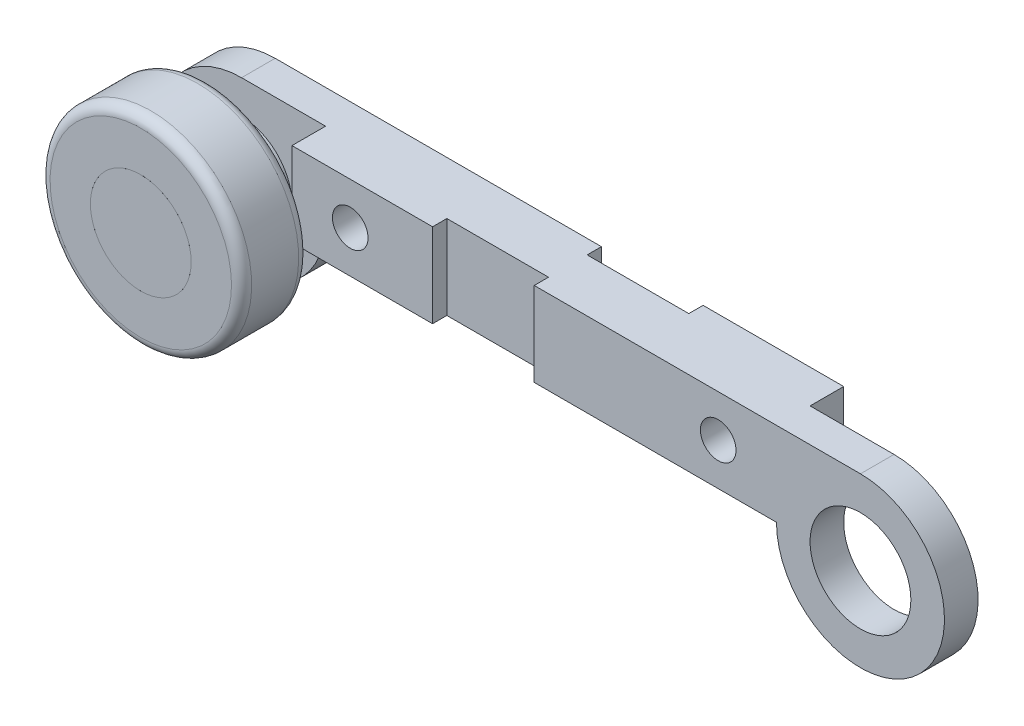
ISO-10303-21;
HEADER;
FILE_DESCRIPTION(('STEP AP214'),'2;1');
FILE_NAME('part.step','',(''),(''),'','','');
FILE_SCHEMA(('AUTOMOTIVE_DESIGN { 1 0 10303 214 1 1 1 1 }'));
ENDSEC;
DATA;
#1=APPLICATION_CONTEXT('core data for automotive mechanical design processes');
#2=APPLICATION_PROTOCOL_DEFINITION('international standard','automotive_design',2000,#1);
#3=PRODUCT_CONTEXT('',#1,'mechanical');
#4=PRODUCT('Part','Part','',(#3));
#5=PRODUCT_RELATED_PRODUCT_CATEGORY('part','',(#4));
#6=PRODUCT_DEFINITION_FORMATION('','',#4);
#7=PRODUCT_DEFINITION_CONTEXT('part definition',#1,'design');
#8=PRODUCT_DEFINITION('design','',#6,#7);
#9=PRODUCT_DEFINITION_SHAPE('','',#8);
#10=(LENGTH_UNIT() NAMED_UNIT(*) SI_UNIT(.MILLI.,.METRE.));
#11=(NAMED_UNIT(*) PLANE_ANGLE_UNIT() SI_UNIT($,.RADIAN.));
#12=(NAMED_UNIT(*) SI_UNIT($,.STERADIAN.) SOLID_ANGLE_UNIT());
#13=UNCERTAINTY_MEASURE_WITH_UNIT(LENGTH_MEASURE(1.E-05),#10,'distance_accuracy_value','');
#14=(GEOMETRIC_REPRESENTATION_CONTEXT(3) GLOBAL_UNCERTAINTY_ASSIGNED_CONTEXT((#13)) GLOBAL_UNIT_ASSIGNED_CONTEXT((#10,
#11,#12)) REPRESENTATION_CONTEXT('',''));
#15=CARTESIAN_POINT('',(0.,0.,0.));
#16=DIRECTION('',(0.,0.,1.));
#17=DIRECTION('',(1.,0.,0.));
#18=AXIS2_PLACEMENT_3D('',#15,#16,#17);
#19=CARTESIAN_POINT('',(-100.953675493499,9.51376137457757,274.2));
#20=DIRECTION('',(0.,0.,-1.));
#21=DIRECTION('',(0.812680732715364,-0.58270921279247,0.));
#22=AXIS2_PLACEMENT_3D('',#19,#20,#21);
#23=CYLINDRICAL_SURFACE('',#22,15.);
#24=CARTESIAN_POINT('',(-100.953675493499,9.51376137457757,274.2));
#25=DIRECTION('',(0.,0.,1.));
#26=DIRECTION('',(-0.812680732715364,0.58270921279247,0.));
#27=AXIS2_PLACEMENT_3D('',#24,#25,#26);
#28=CIRCLE('',#27,15.);
#29=CARTESIAN_POINT('',(-113.14388648423,18.2543995664646,274.2));
#30=VERTEX_POINT('',#29);
#31=EDGE_CURVE('P0_E10',#30,#30,#28,.T.);
#32=ORIENTED_EDGE('',*,*,#31,.F.);
#33=EDGE_LOOP('',(#32));
#34=FACE_BOUND('',#33,.T.);
#35=CARTESIAN_POINT('',(-100.953675493499,9.51376137457757,234.2));
#36=DIRECTION('',(0.,0.,-1.));
#37=DIRECTION('',(0.812680732715364,-0.58270921279247,0.));
#38=AXIS2_PLACEMENT_3D('',#35,#36,#37);
#39=CIRCLE('',#38,15.);
#40=CARTESIAN_POINT('',(-88.7634645027686,0.773123182690525,234.2));
#41=VERTEX_POINT('',#40);
#42=EDGE_CURVE('P0_E21',#41,#41,#39,.T.);
#43=ORIENTED_EDGE('',*,*,#42,.F.);
#44=EDGE_LOOP('',(#43));
#45=FACE_BOUND('',#44,.T.);
#46=ADVANCED_FACE('P0_F15',(#34,#45),#23,.T.);
#47=CARTESIAN_POINT('',(-100.953675493499,9.51376137457757,274.2));
#48=DIRECTION('',(0.,0.,1.));
#49=DIRECTION('',(-0.812680732715364,0.58270921279247,0.));
#50=AXIS2_PLACEMENT_3D('',#47,#48,#49);
#51=PLANE('',#50);
#52=ORIENTED_EDGE('',*,*,#31,.T.);
#53=EDGE_LOOP('',(#52));
#54=FACE_BOUND('',#53,.T.);
#55=ADVANCED_FACE('P0_F49',(#54),#51,.T.);
#56=CARTESIAN_POINT('',(-100.953675493499,9.51376137457757,229.2));
#57=DIRECTION('',(0.,0.,1.));
#58=DIRECTION('',(-0.812680732715364,0.58270921279247,0.));
#59=AXIS2_PLACEMENT_3D('',#56,#57,#58);
#60=CYLINDRICAL_SURFACE('',#59,20.);
#61=CARTESIAN_POINT('',(-100.953675493499,9.51376137457757,229.2));
#62=DIRECTION('',(0.,0.,-1.));
#63=DIRECTION('',(0.812680732715364,-0.58270921279247,0.));
#64=AXIS2_PLACEMENT_3D('',#61,#62,#63);
#65=CIRCLE('',#64,20.);
#66=CARTESIAN_POINT('',(-84.7000608391918,-2.14042288127182,229.2));
#67=VERTEX_POINT('',#66);
#68=EDGE_CURVE('P0_E25',#67,#67,#65,.T.);
#69=ORIENTED_EDGE('',*,*,#68,.F.);
#70=EDGE_LOOP('',(#69));
#71=FACE_BOUND('',#70,.T.);
#72=CARTESIAN_POINT('',(-100.953675493499,9.51376137457757,234.2));
#73=DIRECTION('',(0.,0.,-1.));
#74=DIRECTION('',(0.812680732715364,-0.58270921279247,0.));
#75=AXIS2_PLACEMENT_3D('',#72,#73,#74);
#76=CIRCLE('',#75,20.);
#77=CARTESIAN_POINT('',(-84.7000608391918,-2.14042288127182,234.2));
#78=VERTEX_POINT('',#77);
#79=EDGE_CURVE('P0_E29',#78,#78,#76,.T.);
#80=ORIENTED_EDGE('',*,*,#79,.T.);
#81=EDGE_LOOP('',(#80));
#82=FACE_BOUND('',#81,.T.);
#83=ADVANCED_FACE('P0_F35',(#71,#82),#60,.T.);
#84=CARTESIAN_POINT('',(-100.953675493499,9.51376137457757,229.2));
#85=DIRECTION('',(0.,0.,-1.));
#86=DIRECTION('',(0.812680732715364,-0.58270921279247,0.));
#87=AXIS2_PLACEMENT_3D('',#84,#85,#86);
#88=PLANE('',#87);
#89=ORIENTED_EDGE('',*,*,#68,.T.);
#90=EDGE_LOOP('',(#89));
#91=FACE_BOUND('',#90,.T.);
#92=ADVANCED_FACE('P0_F39',(#91),#88,.T.);
#93=CARTESIAN_POINT('',(-100.953675493499,9.51376137457757,234.2));
#94=DIRECTION('',(0.,0.,-1.));
#95=DIRECTION('',(0.812680732715364,-0.58270921279247,0.));
#96=AXIS2_PLACEMENT_3D('',#93,#94,#95);
#97=PLANE('',#96);
#98=ORIENTED_EDGE('',*,*,#42,.T.);
#99=EDGE_LOOP('',(#98));
#100=FACE_BOUND('',#99,.T.);
#101=ORIENTED_EDGE('',*,*,#79,.F.);
#102=EDGE_LOOP('',(#101));
#103=FACE_BOUND('',#102,.T.);
#104=ADVANCED_FACE('P0_F37',(#100,#103),#97,.F.);
#105=CLOSED_SHELL('',(#46,#55,#83,#92,#104));
#106=MANIFOLD_SOLID_BREP('P0_B1',#105);
#107=CARTESIAN_POINT('',(-100.953675493499,9.51376137457759,274.2));
#108=DIRECTION('',(0.,0.,1.));
#109=DIRECTION('',(0.429903138719744,0.902875014228942,0.));
#110=AXIS2_PLACEMENT_3D('',#107,#108,#109);
#111=PLANE('',#110);
#112=CARTESIAN_POINT('',(-100.953675493499,9.51376137457759,274.2));
#113=DIRECTION('',(0.,0.,1.));
#114=DIRECTION('',(0.429903138719744,0.902875014228942,0.));
#115=AXIS2_PLACEMENT_3D('',#112,#113,#114);
#116=CIRCLE('',#115,27.);
#117=CARTESIAN_POINT('',(-89.346290748066,33.891386758759,274.2));
#118=VERTEX_POINT('',#117);
#119=EDGE_CURVE('P1_E10',#118,#118,#116,.T.);
#120=ORIENTED_EDGE('',*,*,#119,.T.);
#121=EDGE_LOOP('',(#120));
#122=FACE_BOUND('',#121,.T.);
#123=CARTESIAN_POINT('',(-100.953675493499,9.51376137457759,274.2));
#124=DIRECTION('',(0.,0.,1.));
#125=DIRECTION('',(0.429903138719744,0.902875014228942,0.));
#126=AXIS2_PLACEMENT_3D('',#123,#124,#125);
#127=CIRCLE('',#126,15.);
#128=CARTESIAN_POINT('',(-94.5051284127029,23.0568865880117,274.2));
#129=VERTEX_POINT('',#128);
#130=EDGE_CURVE('P1_E35',#129,#129,#127,.T.);
#131=ORIENTED_EDGE('',*,*,#130,.F.);
#132=EDGE_LOOP('',(#131));
#133=FACE_BOUND('',#132,.T.);
#134=ADVANCED_FACE('P1_F15',(#122,#133),#111,.T.);
#135=CARTESIAN_POINT('',(-100.953675493499,9.51376137457759,254.2));
#136=DIRECTION('',(0.,0.,1.));
#137=DIRECTION('',(0.429903138719744,0.902875014228942,0.));
#138=AXIS2_PLACEMENT_3D('',#135,#136,#137);
#139=PLANE('',#138);
#140=CARTESIAN_POINT('',(-100.953675493499,9.51376137457759,254.2));
#141=DIRECTION('',(0.,0.,1.));
#142=DIRECTION('',(0.429903138719744,0.902875014228942,0.));
#143=AXIS2_PLACEMENT_3D('',#140,#141,#142);
#144=CIRCLE('',#143,27.);
#145=CARTESIAN_POINT('',(-89.346290748066,33.891386758759,254.2));
#146=VERTEX_POINT('',#145);
#147=EDGE_CURVE('P1_E22',#146,#146,#144,.F.);
#148=ORIENTED_EDGE('',*,*,#147,.T.);
#149=EDGE_LOOP('',(#148));
#150=FACE_BOUND('',#149,.T.);
#151=CARTESIAN_POINT('',(-100.953675493499,9.51376137457759,254.2));
#152=DIRECTION('',(0.,0.,1.));
#153=DIRECTION('',(0.429903138719744,0.902875014228942,0.));
#154=AXIS2_PLACEMENT_3D('',#151,#152,#153);
#155=CIRCLE('',#154,15.);
#156=CARTESIAN_POINT('',(-94.5051284127029,23.0568865880117,254.2));
#157=VERTEX_POINT('',#156);
#158=EDGE_CURVE('P1_E36',#157,#157,#155,.T.);
#159=ORIENTED_EDGE('',*,*,#158,.T.);
#160=EDGE_LOOP('',(#159));
#161=FACE_BOUND('',#160,.T.);
#162=ADVANCED_FACE('P1_F46',(#150,#161),#139,.F.);
#163=CARTESIAN_POINT('',(-100.953675493499,9.51376137457759,274.2));
#164=DIRECTION('',(0.,0.,-1.));
#165=DIRECTION('',(-0.429903138719744,-0.902875014228942,0.));
#166=AXIS2_PLACEMENT_3D('',#163,#164,#165);
#167=CYLINDRICAL_SURFACE('',#166,30.);
#168=CARTESIAN_POINT('',(-100.953675493499,9.51376137457759,257.2));
#169=DIRECTION('',(0.,0.,1.));
#170=DIRECTION('',(0.429903138719744,0.902875014228942,0.));
#171=AXIS2_PLACEMENT_3D('',#168,#169,#170);
#172=CIRCLE('',#171,30.);
#173=CARTESIAN_POINT('',(-88.0565813319068,36.6000118014459,257.2));
#174=VERTEX_POINT('',#173);
#175=EDGE_CURVE('P1_E26',#174,#174,#172,.T.);
#176=ORIENTED_EDGE('',*,*,#175,.T.);
#177=EDGE_LOOP('',(#176));
#178=FACE_BOUND('',#177,.T.);
#179=CARTESIAN_POINT('',(-100.953675493499,9.51376137457759,271.2));
#180=DIRECTION('',(0.,0.,1.));
#181=DIRECTION('',(0.429903138719744,0.902875014228942,0.));
#182=AXIS2_PLACEMENT_3D('',#179,#180,#181);
#183=CIRCLE('',#182,30.);
#184=CARTESIAN_POINT('',(-88.0565813319068,36.6000118014459,271.2));
#185=VERTEX_POINT('',#184);
#186=EDGE_CURVE('P1_E30',#185,#185,#183,.F.);
#187=ORIENTED_EDGE('',*,*,#186,.T.);
#188=EDGE_LOOP('',(#187));
#189=FACE_BOUND('',#188,.T.);
#190=ADVANCED_FACE('P1_F52',(#178,#189),#167,.T.);
#191=CARTESIAN_POINT('',(-100.953675493499,9.51376137457759,274.2));
#192=DIRECTION('',(0.,0.,-1.));
#193=DIRECTION('',(-0.429903138719744,-0.902875014228942,0.));
#194=AXIS2_PLACEMENT_3D('',#191,#192,#193);
#195=CYLINDRICAL_SURFACE('',#194,15.);
#196=ORIENTED_EDGE('',*,*,#130,.T.);
#197=EDGE_LOOP('',(#196));
#198=FACE_BOUND('',#197,.T.);
#199=ORIENTED_EDGE('',*,*,#158,.F.);
#200=EDGE_LOOP('',(#199));
#201=FACE_BOUND('',#200,.T.);
#202=ADVANCED_FACE('P1_F42',(#198,#201),#195,.F.);
#203=CARTESIAN_POINT('',(-100.953675493499,9.51376137457759,257.2));
#204=DIRECTION('',(0.,0.,1.));
#205=DIRECTION('',(0.429903138719744,0.902875014228942,0.));
#206=AXIS2_PLACEMENT_3D('',#203,#204,#205);
#207=TOROIDAL_SURFACE('',#206,27.,3.);
#208=ORIENTED_EDGE('',*,*,#147,.F.);
#209=EDGE_LOOP('',(#208));
#210=FACE_BOUND('',#209,.T.);
#211=ORIENTED_EDGE('',*,*,#175,.F.);
#212=EDGE_LOOP('',(#211));
#213=FACE_BOUND('',#212,.T.);
#214=ADVANCED_FACE('P1_F58',(#210,#213),#207,.T.);
#215=CARTESIAN_POINT('',(-100.953675493499,9.51376137457759,271.2));
#216=DIRECTION('',(0.,0.,1.));
#217=DIRECTION('',(0.429903138719744,0.902875014228942,0.));
#218=AXIS2_PLACEMENT_3D('',#215,#216,#217);
#219=TOROIDAL_SURFACE('',#218,27.,3.);
#220=ORIENTED_EDGE('',*,*,#186,.F.);
#221=EDGE_LOOP('',(#220));
#222=FACE_BOUND('',#221,.T.);
#223=ORIENTED_EDGE('',*,*,#119,.F.);
#224=EDGE_LOOP('',(#223));
#225=FACE_BOUND('',#224,.T.);
#226=ADVANCED_FACE('P1_F17',(#222,#225),#219,.T.);
#227=CLOSED_SHELL('',(#134,#162,#190,#202,#214,#226));
#228=MANIFOLD_SOLID_BREP('P1_B1',#227);
#229=CARTESIAN_POINT('',(-100.953675493499,9.51376137457759,234.2));
#230=DIRECTION('',(0.,0.,1.));
#231=DIRECTION('',(1.,0.,0.));
#232=AXIS2_PLACEMENT_3D('',#229,#230,#231);
#233=PLANE('',#232);
#234=CARTESIAN_POINT('',(-100.953675493499,9.51376137457759,234.2));
#235=DIRECTION('',(0.,0.,1.));
#236=DIRECTION('',(1.,0.,0.));
#237=AXIS2_PLACEMENT_3D('',#234,#235,#236);
#238=CIRCLE('',#237,15.);
#239=CARTESIAN_POINT('',(-85.9536754934991,9.51376137457759,234.2));
#240=VERTEX_POINT('',#239);
#241=EDGE_CURVE('P2_E231',#240,#240,#238,.T.);
#242=ORIENTED_EDGE('',*,*,#241,.T.);
#243=EDGE_LOOP('',(#242));
#244=FACE_BOUND('',#243,.T.);
#245=CARTESIAN_POINT('',(-58.6086401104718,22.0137613745776,234.2));
#246=DIRECTION('',(0.,0.,1.));
#247=DIRECTION('',(1.,0.,0.));
#248=AXIS2_PLACEMENT_3D('',#245,#246,#247);
#249=CIRCLE('',#248,5.29788538285587);
#250=CARTESIAN_POINT('',(-53.3107547276159,22.0137613745776,234.2));
#251=VERTEX_POINT('',#250);
#252=EDGE_CURVE('P2_E196',#251,#251,#249,.F.);
#253=ORIENTED_EDGE('',*,*,#252,.F.);
#254=EDGE_LOOP('',(#253));
#255=FACE_BOUND('',#254,.T.);
#256=DIRECTION('',(-1.,0.,0.));
#257=VECTOR('',#256,1.);
#258=CARTESIAN_POINT('',(-100.953675493499,34.5137613745776,234.2));
#259=LINE('',#258,#257);
#260=CARTESIAN_POINT('',(-3.85367549349908,34.5137613745776,234.2));
#261=VERTEX_POINT('',#260);
#262=CARTESIAN_POINT('',(-100.953675493499,34.5137613745776,234.2));
#263=VERTEX_POINT('',#262);
#264=EDGE_CURVE('P2_E252',#261,#263,#259,.T.);
#265=ORIENTED_EDGE('',*,*,#264,.F.);
#266=DIRECTION('',(0.,1.,0.));
#267=VECTOR('',#266,1.);
#268=CARTESIAN_POINT('',(-3.85367549349908,3.51376137457758,234.2));
#269=LINE('',#268,#267);
#270=CARTESIAN_POINT('',(-3.85367549349908,9.51376137457759,234.2));
#271=VERTEX_POINT('',#270);
#272=EDGE_CURVE('P2_E154',#271,#261,#269,.T.);
#273=ORIENTED_EDGE('',*,*,#272,.F.);
#274=DIRECTION('',(1.,0.,0.));
#275=VECTOR('',#274,1.);
#276=CARTESIAN_POINT('',(-75.9536754934991,9.51376137457759,234.2));
#277=LINE('',#276,#275);
#278=CARTESIAN_POINT('',(-75.9536754934991,9.51376137457759,234.2));
#279=VERTEX_POINT('',#278);
#280=EDGE_CURVE('P2_E249',#279,#271,#277,.T.);
#281=ORIENTED_EDGE('',*,*,#280,.F.);
#282=CARTESIAN_POINT('',(-100.953675493499,9.51376137457759,234.2));
#283=DIRECTION('',(0.,0.,1.));
#284=DIRECTION('',(1.,0.,0.));
#285=AXIS2_PLACEMENT_3D('',#282,#283,#284);
#286=CIRCLE('',#285,25.);
#287=EDGE_CURVE('P2_E234',#263,#279,#286,.T.);
#288=ORIENTED_EDGE('',*,*,#287,.F.);
#289=EDGE_LOOP('',(#265,#273,#281,#288));
#290=FACE_BOUND('',#289,.T.);
#291=ADVANCED_FACE('P2_F17',(#244,#255,#290),#233,.F.);
#292=CARTESIAN_POINT('',(-100.953675493499,9.51376137457759,254.2));
#293=DIRECTION('',(0.,0.,1.));
#294=DIRECTION('',(1.,0.,0.));
#295=AXIS2_PLACEMENT_3D('',#292,#293,#294);
#296=PLANE('',#295);
#297=DIRECTION('',(0.,1.,0.));
#298=VECTOR('',#297,1.);
#299=CARTESIAN_POINT('',(-34.1064185010502,3.51376137457758,254.2));
#300=LINE('',#299,#298);
#301=CARTESIAN_POINT('',(-34.1064185010502,9.51376137457759,254.2));
#302=VERTEX_POINT('',#301);
#303=CARTESIAN_POINT('',(-34.1064185010502,34.5137613745776,254.2));
#304=VERTEX_POINT('',#303);
#305=EDGE_CURVE('P2_E170',#302,#304,#300,.T.);
#306=ORIENTED_EDGE('',*,*,#305,.T.);
#307=DIRECTION('',(-1.,0.,0.));
#308=VECTOR('',#307,1.);
#309=CARTESIAN_POINT('',(-100.953675493499,34.5137613745776,254.2));
#310=LINE('',#309,#308);
#311=CARTESIAN_POINT('',(-75.9536754934991,34.5137613745776,254.2));
#312=VERTEX_POINT('',#311);
#313=EDGE_CURVE('P2_E241',#304,#312,#310,.T.);
#314=ORIENTED_EDGE('',*,*,#313,.T.);
#315=DIRECTION('',(0.,1.,0.));
#316=VECTOR('',#315,1.);
#317=CARTESIAN_POINT('',(-75.9536754934991,-49.4862386254224,254.2));
#318=LINE('',#317,#316);
#319=CARTESIAN_POINT('',(-75.9536754934991,9.51376137457759,254.2));
#320=VERTEX_POINT('',#319);
#321=EDGE_CURVE('P2_E220',#320,#312,#318,.T.);
#322=ORIENTED_EDGE('',*,*,#321,.F.);
#323=DIRECTION('',(1.,0.,0.));
#324=VECTOR('',#323,1.);
#325=CARTESIAN_POINT('',(-75.9536754934991,9.51376137457759,254.2));
#326=LINE('',#325,#324);
#327=EDGE_CURVE('P2_E235',#320,#302,#326,.T.);
#328=ORIENTED_EDGE('',*,*,#327,.T.);
#329=EDGE_LOOP('',(#306,#314,#322,#328));
#330=FACE_BOUND('',#329,.T.);
#331=CARTESIAN_POINT('',(-58.6086401104718,22.0137613745776,254.2));
#332=DIRECTION('',(0.,0.,1.));
#333=DIRECTION('',(1.,0.,0.));
#334=AXIS2_PLACEMENT_3D('',#331,#332,#333);
#335=CIRCLE('',#334,5.29788538285587);
#336=CARTESIAN_POINT('',(-53.3107547276159,22.0137613745776,254.2));
#337=VERTEX_POINT('',#336);
#338=EDGE_CURVE('P2_E193',#337,#337,#335,.T.);
#339=ORIENTED_EDGE('',*,*,#338,.F.);
#340=EDGE_LOOP('',(#339));
#341=FACE_BOUND('',#340,.T.);
#342=ADVANCED_FACE('P2_F276',(#330,#341),#296,.T.);
#343=DIRECTION('',(0.,1.,0.));
#344=VECTOR('',#343,1.);
#345=CARTESIAN_POINT('',(-3.85367549349908,3.51376137457758,254.2));
#346=LINE('',#345,#344);
#347=CARTESIAN_POINT('',(-3.85367549349908,9.51376137457759,254.2));
#348=VERTEX_POINT('',#347);
#349=CARTESIAN_POINT('',(-3.85367549349908,34.5137613745776,254.2));
#350=VERTEX_POINT('',#349);
#351=EDGE_CURVE('P2_E42',#348,#350,#346,.T.);
#352=ORIENTED_EDGE('',*,*,#351,.F.);
#353=CARTESIAN_POINT('',(68.2463245065009,9.51376137457759,254.2));
#354=VERTEX_POINT('',#353);
#355=EDGE_CURVE('P2_E239',#348,#354,#326,.T.);
#356=ORIENTED_EDGE('',*,*,#355,.T.);
#357=CARTESIAN_POINT('',(93.2463245065009,9.51376137457759,254.2));
#358=DIRECTION('',(0.,0.,1.));
#359=DIRECTION('',(1.,0.,0.));
#360=AXIS2_PLACEMENT_3D('',#357,#358,#359);
#361=CIRCLE('',#360,25.);
#362=CARTESIAN_POINT('',(93.2463245065009,34.5137613745776,254.2));
#363=VERTEX_POINT('',#362);
#364=EDGE_CURVE('P2_E238',#354,#363,#361,.T.);
#365=ORIENTED_EDGE('',*,*,#364,.T.);
#366=EDGE_CURVE('P2_E242',#363,#350,#310,.T.);
#367=ORIENTED_EDGE('',*,*,#366,.T.);
#368=EDGE_LOOP('',(#352,#356,#365,#367));
#369=FACE_BOUND('',#368,.T.);
#370=CARTESIAN_POINT('',(50.9012891234736,22.0137613745776,254.2));
#371=DIRECTION('',(0.,0.,1.));
#372=DIRECTION('',(-1.,0.,0.));
#373=AXIS2_PLACEMENT_3D('',#370,#371,#372);
#374=CIRCLE('',#373,5.29788538285587);
#375=CARTESIAN_POINT('',(45.6034037406178,22.0137613745776,254.2));
#376=VERTEX_POINT('',#375);
#377=EDGE_CURVE('P2_E187',#376,#376,#374,.T.);
#378=ORIENTED_EDGE('',*,*,#377,.F.);
#379=EDGE_LOOP('',(#378));
#380=FACE_BOUND('',#379,.T.);
#381=CARTESIAN_POINT('',(93.2463245065009,9.51376137457759,254.2));
#382=DIRECTION('',(0.,0.,1.));
#383=DIRECTION('',(1.,0.,0.));
#384=AXIS2_PLACEMENT_3D('',#381,#382,#383);
#385=CIRCLE('',#384,15.);
#386=CARTESIAN_POINT('',(108.246324506501,9.51376137457759,254.2));
#387=VERTEX_POINT('',#386);
#388=EDGE_CURVE('P2_E228',#387,#387,#385,.T.);
#389=ORIENTED_EDGE('',*,*,#388,.F.);
#390=EDGE_LOOP('',(#389));
#391=FACE_BOUND('',#390,.T.);
#392=ADVANCED_FACE('P2_F310',(#369,#380,#391),#296,.T.);
#393=CARTESIAN_POINT('',(50.9012891234736,22.0137613745776,234.2));
#394=DIRECTION('',(0.,0.,1.));
#395=DIRECTION('',(1.,0.,0.));
#396=AXIS2_PLACEMENT_3D('',#393,#394,#395);
#397=CIRCLE('',#396,5.29788538285587);
#398=CARTESIAN_POINT('',(56.1991745063295,22.0137613745776,234.2));
#399=VERTEX_POINT('',#398);
#400=EDGE_CURVE('P2_E190',#399,#399,#397,.F.);
#401=ORIENTED_EDGE('',*,*,#400,.F.);
#402=EDGE_LOOP('',(#401));
#403=FACE_BOUND('',#402,.T.);
#404=CARTESIAN_POINT('',(26.399067514052,9.51376137457759,234.2));
#405=VERTEX_POINT('',#404);
#406=CARTESIAN_POINT('',(68.2463245065009,9.51376137457759,234.2));
#407=VERTEX_POINT('',#406);
#408=EDGE_CURVE('P2_E248',#405,#407,#277,.T.);
#409=ORIENTED_EDGE('',*,*,#408,.F.);
#410=DIRECTION('',(0.,1.,0.));
#411=VECTOR('',#410,1.);
#412=CARTESIAN_POINT('',(26.399067514052,3.51376137457758,234.2));
#413=LINE('',#412,#411);
#414=CARTESIAN_POINT('',(26.399067514052,34.5137613745776,234.2));
#415=VERTEX_POINT('',#414);
#416=EDGE_CURVE('P2_E137',#405,#415,#413,.T.);
#417=ORIENTED_EDGE('',*,*,#416,.T.);
#418=CARTESIAN_POINT('',(68.2463245065009,34.5137613745776,234.2));
#419=VERTEX_POINT('',#418);
#420=EDGE_CURVE('P2_E149',#419,#415,#259,.T.);
#421=ORIENTED_EDGE('',*,*,#420,.F.);
#422=DIRECTION('',(0.,1.,0.));
#423=VECTOR('',#422,1.);
#424=CARTESIAN_POINT('',(68.2463245065009,-49.4862386254224,234.2));
#425=LINE('',#424,#423);
#426=EDGE_CURVE('P2_E205',#407,#419,#425,.T.);
#427=ORIENTED_EDGE('',*,*,#426,.F.);
#428=EDGE_LOOP('',(#409,#417,#421,#427));
#429=FACE_BOUND('',#428,.T.);
#430=ADVANCED_FACE('P2_F278',(#403,#429),#233,.F.);
#431=CARTESIAN_POINT('',(-100.953675493499,9.51376137457759,254.2));
#432=DIRECTION('',(0.,0.,-1.));
#433=DIRECTION('',(-1.,0.,0.));
#434=AXIS2_PLACEMENT_3D('',#431,#432,#433);
#435=CYLINDRICAL_SURFACE('',#434,25.);
#436=CARTESIAN_POINT('',(-100.953675493499,9.51376137457759,244.2));
#437=DIRECTION('',(0.,0.,-1.));
#438=DIRECTION('',(-1.,0.,0.));
#439=AXIS2_PLACEMENT_3D('',#436,#437,#438);
#440=CIRCLE('',#439,25.);
#441=CARTESIAN_POINT('',(-75.9536754934991,9.51376137457759,244.2));
#442=VERTEX_POINT('',#441);
#443=CARTESIAN_POINT('',(-100.953675493499,34.5137613745776,244.2));
#444=VERTEX_POINT('',#443);
#445=EDGE_CURVE('P2_E226',#442,#444,#440,.T.);
#446=ORIENTED_EDGE('',*,*,#445,.T.);
#447=DIRECTION('',(0.,0.,-1.));
#448=VECTOR('',#447,1.);
#449=CARTESIAN_POINT('',(-100.953675493499,34.5137613745776,254.2));
#450=LINE('',#449,#448);
#451=EDGE_CURVE('P2_E245',#444,#263,#450,.T.);
#452=ORIENTED_EDGE('',*,*,#451,.T.);
#453=ORIENTED_EDGE('',*,*,#287,.T.);
#454=DIRECTION('',(0.,0.,-1.));
#455=VECTOR('',#454,1.);
#456=CARTESIAN_POINT('',(-75.9536754934991,9.51376137457759,254.2));
#457=LINE('',#456,#455);
#458=EDGE_CURVE('P2_E26',#442,#279,#457,.T.);
#459=ORIENTED_EDGE('',*,*,#458,.F.);
#460=EDGE_LOOP('',(#446,#452,#453,#459));
#461=FACE_BOUND('',#460,.T.);
#462=ADVANCED_FACE('P2_F19',(#461),#435,.T.);
#463=CARTESIAN_POINT('',(-75.9536754934991,9.51376137457759,254.2));
#464=DIRECTION('',(0.,1.,0.));
#465=DIRECTION('',(0.,0.,1.));
#466=AXIS2_PLACEMENT_3D('',#463,#464,#465);
#467=PLANE('',#466);
#468=ORIENTED_EDGE('',*,*,#280,.T.);
#469=DIRECTION('',(0.,0.,1.));
#470=VECTOR('',#469,1.);
#471=CARTESIAN_POINT('',(-3.85367549349908,9.51376137457759,254.2));
#472=LINE('',#471,#470);
#473=CARTESIAN_POINT('',(-3.85367549349908,9.51376137457759,238.449478601871));
#474=VERTEX_POINT('',#473);
#475=EDGE_CURVE('P2_E160',#271,#474,#472,.T.);
#476=ORIENTED_EDGE('',*,*,#475,.T.);
#477=DIRECTION('',(1.,0.,0.));
#478=VECTOR('',#477,1.);
#479=CARTESIAN_POINT('',(-75.9536754934991,9.51376137457759,238.449478601871));
#480=LINE('',#479,#478);
#481=CARTESIAN_POINT('',(26.399067514052,9.51376137457759,238.449478601871));
#482=VERTEX_POINT('',#481);
#483=EDGE_CURVE('P2_E156',#474,#482,#480,.T.);
#484=ORIENTED_EDGE('',*,*,#483,.T.);
#485=DIRECTION('',(0.,0.,-1.));
#486=VECTOR('',#485,1.);
#487=CARTESIAN_POINT('',(26.399067514052,9.51376137457759,254.2));
#488=LINE('',#487,#486);
#489=EDGE_CURVE('P2_E134',#482,#405,#488,.T.);
#490=ORIENTED_EDGE('',*,*,#489,.T.);
#491=ORIENTED_EDGE('',*,*,#408,.T.);
#492=DIRECTION('',(0.,0.,-1.));
#493=VECTOR('',#492,1.);
#494=CARTESIAN_POINT('',(68.2463245065009,9.51376137457759,254.2));
#495=LINE('',#494,#493);
#496=CARTESIAN_POINT('',(68.2463245065009,9.51376137457759,244.2));
#497=VERTEX_POINT('',#496);
#498=EDGE_CURVE('P2_E211',#497,#407,#495,.T.);
#499=ORIENTED_EDGE('',*,*,#498,.F.);
#500=DIRECTION('',(0.,0.,-1.));
#501=VECTOR('',#500,1.);
#502=CARTESIAN_POINT('',(68.2463245065009,9.51376137457759,254.2));
#503=LINE('',#502,#501);
#504=EDGE_CURVE('P2_E259',#354,#497,#503,.T.);
#505=ORIENTED_EDGE('',*,*,#504,.F.);
#506=ORIENTED_EDGE('',*,*,#355,.F.);
#507=DIRECTION('',(0.,0.,-1.));
#508=VECTOR('',#507,1.);
#509=CARTESIAN_POINT('',(-3.85367549349908,9.51376137457759,254.2));
#510=LINE('',#509,#508);
#511=CARTESIAN_POINT('',(-3.85367549349908,9.51376137457759,249.950521398129));
#512=VERTEX_POINT('',#511);
#513=EDGE_CURVE('P2_E173',#348,#512,#510,.T.);
#514=ORIENTED_EDGE('',*,*,#513,.T.);
#515=DIRECTION('',(-1.,0.,0.));
#516=VECTOR('',#515,1.);
#517=CARTESIAN_POINT('',(-75.9536754934991,9.51376137457759,249.950521398129));
#518=LINE('',#517,#516);
#519=CARTESIAN_POINT('',(-34.1064185010502,9.51376137457759,249.950521398129));
#520=VERTEX_POINT('',#519);
#521=EDGE_CURVE('P2_E181',#512,#520,#518,.T.);
#522=ORIENTED_EDGE('',*,*,#521,.T.);
#523=DIRECTION('',(0.,0.,1.));
#524=VECTOR('',#523,1.);
#525=CARTESIAN_POINT('',(-34.1064185010502,9.51376137457759,254.2));
#526=LINE('',#525,#524);
#527=EDGE_CURVE('P2_E184',#520,#302,#526,.T.);
#528=ORIENTED_EDGE('',*,*,#527,.T.);
#529=ORIENTED_EDGE('',*,*,#327,.F.);
#530=EDGE_CURVE('P2_E11',#320,#442,#457,.T.);
#531=ORIENTED_EDGE('',*,*,#530,.T.);
#532=ORIENTED_EDGE('',*,*,#458,.T.);
#533=EDGE_LOOP('',(#468,#476,#484,#490,#491,#499,#505,#506,#514,#522,#528,#529,#531,#532));
#534=FACE_BOUND('',#533,.T.);
#535=ADVANCED_FACE('P2_F300',(#534),#467,.F.);
#536=CARTESIAN_POINT('',(93.2463245065009,9.51376137457759,254.2));
#537=DIRECTION('',(0.,0.,-1.));
#538=DIRECTION('',(-1.,0.,0.));
#539=AXIS2_PLACEMENT_3D('',#536,#537,#538);
#540=CYLINDRICAL_SURFACE('',#539,25.);
#541=CARTESIAN_POINT('',(93.2463245065009,9.51376137457759,244.2));
#542=DIRECTION('',(0.,0.,1.));
#543=DIRECTION('',(1.,0.,0.));
#544=AXIS2_PLACEMENT_3D('',#541,#542,#543);
#545=CIRCLE('',#544,25.);
#546=CARTESIAN_POINT('',(93.2463245065009,34.5137613745776,244.2));
#547=VERTEX_POINT('',#546);
#548=EDGE_CURVE('P2_E209',#497,#547,#545,.T.);
#549=ORIENTED_EDGE('',*,*,#548,.T.);
#550=DIRECTION('',(0.,0.,-1.));
#551=VECTOR('',#550,1.);
#552=CARTESIAN_POINT('',(93.2463245065009,34.5137613745776,254.2));
#553=LINE('',#552,#551);
#554=EDGE_CURVE('P2_E256',#363,#547,#553,.T.);
#555=ORIENTED_EDGE('',*,*,#554,.F.);
#556=ORIENTED_EDGE('',*,*,#364,.F.);
#557=ORIENTED_EDGE('',*,*,#504,.T.);
#558=EDGE_LOOP('',(#549,#555,#556,#557));
#559=FACE_BOUND('',#558,.T.);
#560=ADVANCED_FACE('P2_F317',(#559),#540,.T.);
#561=CARTESIAN_POINT('',(-100.953675493499,34.5137613745776,254.2));
#562=DIRECTION('',(0.,-1.,0.));
#563=DIRECTION('',(1.,0.,0.));
#564=AXIS2_PLACEMENT_3D('',#561,#562,#563);
#565=PLANE('',#564);
#566=DIRECTION('',(1.,0.,0.));
#567=VECTOR('',#566,1.);
#568=CARTESIAN_POINT('',(-3.85367549349908,34.5137613745776,238.449478601871));
#569=LINE('',#568,#567);
#570=CARTESIAN_POINT('',(-3.85367549349908,34.5137613745776,238.449478601871));
#571=VERTEX_POINT('',#570);
#572=CARTESIAN_POINT('',(26.399067514052,34.5137613745776,238.449478601871));
#573=VERTEX_POINT('',#572);
#574=EDGE_CURVE('P2_E141',#571,#573,#569,.T.);
#575=ORIENTED_EDGE('',*,*,#574,.F.);
#576=DIRECTION('',(0.,0.,1.));
#577=VECTOR('',#576,1.);
#578=CARTESIAN_POINT('',(-3.85367549349908,34.5137613745776,238.449478601871));
#579=LINE('',#578,#577);
#580=EDGE_CURVE('P2_E34',#261,#571,#579,.T.);
#581=ORIENTED_EDGE('',*,*,#580,.F.);
#582=ORIENTED_EDGE('',*,*,#264,.T.);
#583=ORIENTED_EDGE('',*,*,#451,.F.);
#584=DIRECTION('',(-1.,0.,0.));
#585=VECTOR('',#584,1.);
#586=CARTESIAN_POINT('',(-125.953675493499,34.5137613745776,244.2));
#587=LINE('',#586,#585);
#588=CARTESIAN_POINT('',(-75.9536754934991,34.5137613745776,244.2));
#589=VERTEX_POINT('',#588);
#590=EDGE_CURVE('P2_E217',#589,#444,#587,.T.);
#591=ORIENTED_EDGE('',*,*,#590,.F.);
#592=DIRECTION('',(0.,0.,-1.));
#593=VECTOR('',#592,1.);
#594=CARTESIAN_POINT('',(-75.9536754934991,34.5137613745776,254.2));
#595=LINE('',#594,#593);
#596=EDGE_CURVE('P2_E214',#312,#589,#595,.T.);
#597=ORIENTED_EDGE('',*,*,#596,.F.);
#598=ORIENTED_EDGE('',*,*,#313,.F.);
#599=DIRECTION('',(0.,0.,1.));
#600=VECTOR('',#599,1.);
#601=CARTESIAN_POINT('',(-34.1064185010502,34.5137613745776,254.2));
#602=LINE('',#601,#600);
#603=CARTESIAN_POINT('',(-34.1064185010502,34.5137613745776,249.950521398129));
#604=VERTEX_POINT('',#603);
#605=EDGE_CURVE('P2_E163',#604,#304,#602,.T.);
#606=ORIENTED_EDGE('',*,*,#605,.F.);
#607=DIRECTION('',(-1.,0.,0.));
#608=VECTOR('',#607,1.);
#609=CARTESIAN_POINT('',(-34.1064185010502,34.5137613745776,249.950521398129));
#610=LINE('',#609,#608);
#611=CARTESIAN_POINT('',(-3.85367549349908,34.5137613745776,249.950521398129));
#612=VERTEX_POINT('',#611);
#613=EDGE_CURVE('P2_E167',#612,#604,#610,.T.);
#614=ORIENTED_EDGE('',*,*,#613,.F.);
#615=DIRECTION('',(0.,0.,-1.));
#616=VECTOR('',#615,1.);
#617=CARTESIAN_POINT('',(-3.85367549349908,34.5137613745776,254.2));
#618=LINE('',#617,#616);
#619=EDGE_CURVE('P2_E165',#350,#612,#618,.T.);
#620=ORIENTED_EDGE('',*,*,#619,.F.);
#621=ORIENTED_EDGE('',*,*,#366,.F.);
#622=ORIENTED_EDGE('',*,*,#554,.T.);
#623=DIRECTION('',(1.,0.,0.));
#624=VECTOR('',#623,1.);
#625=CARTESIAN_POINT('',(68.2463245065009,34.5137613745776,244.2));
#626=LINE('',#625,#624);
#627=CARTESIAN_POINT('',(68.2463245065009,34.5137613745776,244.2));
#628=VERTEX_POINT('',#627);
#629=EDGE_CURVE('P2_E201',#628,#547,#626,.T.);
#630=ORIENTED_EDGE('',*,*,#629,.F.);
#631=DIRECTION('',(0.,0.,1.));
#632=VECTOR('',#631,1.);
#633=CARTESIAN_POINT('',(68.2463245065009,34.5137613745776,234.2));
#634=LINE('',#633,#632);
#635=EDGE_CURVE('P2_E199',#419,#628,#634,.T.);
#636=ORIENTED_EDGE('',*,*,#635,.F.);
#637=ORIENTED_EDGE('',*,*,#420,.T.);
#638=DIRECTION('',(0.,0.,-1.));
#639=VECTOR('',#638,1.);
#640=CARTESIAN_POINT('',(26.399067514052,34.5137613745776,238.449478601871));
#641=LINE('',#640,#639);
#642=EDGE_CURVE('P2_E131',#573,#415,#641,.T.);
#643=ORIENTED_EDGE('',*,*,#642,.F.);
#644=EDGE_LOOP('',(#575,#581,#582,#583,#591,#597,#598,#606,#614,#620,#621,#622,#630,#636,#637,#643));
#645=FACE_BOUND('',#644,.T.);
#646=ADVANCED_FACE('P2_F146',(#645),#565,.F.);
#647=CARTESIAN_POINT('',(-100.953675493499,9.51376137457759,254.2));
#648=DIRECTION('',(0.,0.,-1.));
#649=DIRECTION('',(-1.,0.,0.));
#650=AXIS2_PLACEMENT_3D('',#647,#648,#649);
#651=CYLINDRICAL_SURFACE('',#650,15.);
#652=CARTESIAN_POINT('',(-100.953675493499,9.51376137457759,244.2));
#653=DIRECTION('',(0.,0.,-1.));
#654=DIRECTION('',(-1.,0.,0.));
#655=AXIS2_PLACEMENT_3D('',#652,#653,#654);
#656=CIRCLE('',#655,15.);
#657=CARTESIAN_POINT('',(-115.953675493499,9.51376137457759,244.2));
#658=VERTEX_POINT('',#657);
#659=EDGE_CURVE('P2_E223',#658,#658,#656,.T.);
#660=ORIENTED_EDGE('',*,*,#659,.F.);
#661=EDGE_LOOP('',(#660));
#662=FACE_BOUND('',#661,.T.);
#663=ORIENTED_EDGE('',*,*,#241,.F.);
#664=EDGE_LOOP('',(#663));
#665=FACE_BOUND('',#664,.T.);
#666=ADVANCED_FACE('P2_F267',(#662,#665),#651,.F.);
#667=CARTESIAN_POINT('',(93.2463245065009,9.51376137457759,254.2));
#668=DIRECTION('',(0.,0.,-1.));
#669=DIRECTION('',(-1.,0.,0.));
#670=AXIS2_PLACEMENT_3D('',#667,#668,#669);
#671=CYLINDRICAL_SURFACE('',#670,15.);
#672=CARTESIAN_POINT('',(93.2463245065009,9.51376137457759,244.2));
#673=DIRECTION('',(0.,0.,1.));
#674=DIRECTION('',(1.,0.,0.));
#675=AXIS2_PLACEMENT_3D('',#672,#673,#674);
#676=CIRCLE('',#675,15.);
#677=CARTESIAN_POINT('',(108.246324506501,9.51376137457759,244.2));
#678=VERTEX_POINT('',#677);
#679=EDGE_CURVE('P2_E21',#678,#678,#676,.T.);
#680=ORIENTED_EDGE('',*,*,#679,.F.);
#681=EDGE_LOOP('',(#680));
#682=FACE_BOUND('',#681,.T.);
#683=ORIENTED_EDGE('',*,*,#388,.T.);
#684=EDGE_LOOP('',(#683));
#685=FACE_BOUND('',#684,.T.);
#686=ADVANCED_FACE('P2_F270',(#682,#685),#671,.F.);
#687=CARTESIAN_POINT('',(-75.9536754934991,-49.4862386254224,254.2));
#688=DIRECTION('',(1.,0.,0.));
#689=DIRECTION('',(0.,1.,0.));
#690=AXIS2_PLACEMENT_3D('',#687,#688,#689);
#691=PLANE('',#690);
#692=ORIENTED_EDGE('',*,*,#321,.T.);
#693=ORIENTED_EDGE('',*,*,#596,.T.);
#694=DIRECTION('',(0.,1.,0.));
#695=VECTOR('',#694,1.);
#696=CARTESIAN_POINT('',(-75.9536754934991,-49.4862386254224,244.2));
#697=LINE('',#696,#695);
#698=EDGE_CURVE('P2_E221',#442,#589,#697,.T.);
#699=ORIENTED_EDGE('',*,*,#698,.F.);
#700=ORIENTED_EDGE('',*,*,#530,.F.);
#701=EDGE_LOOP('',(#692,#693,#699,#700));
#702=FACE_BOUND('',#701,.T.);
#703=ADVANCED_FACE('P2_F294',(#702),#691,.F.);
#704=CARTESIAN_POINT('',(-125.953675493499,-49.4862386254224,244.2));
#705=DIRECTION('',(0.,0.,-1.));
#706=DIRECTION('',(-1.,0.,0.));
#707=AXIS2_PLACEMENT_3D('',#704,#705,#706);
#708=PLANE('',#707);
#709=ORIENTED_EDGE('',*,*,#659,.T.);
#710=EDGE_LOOP('',(#709));
#711=FACE_BOUND('',#710,.T.);
#712=ORIENTED_EDGE('',*,*,#445,.F.);
#713=ORIENTED_EDGE('',*,*,#698,.T.);
#714=ORIENTED_EDGE('',*,*,#590,.T.);
#715=EDGE_LOOP('',(#712,#713,#714));
#716=FACE_BOUND('',#715,.T.);
#717=ADVANCED_FACE('P2_F264',(#711,#716),#708,.F.);
#718=CARTESIAN_POINT('',(68.2463245065009,-49.4862386254224,244.2));
#719=DIRECTION('',(0.,0.,1.));
#720=DIRECTION('',(1.,0.,0.));
#721=AXIS2_PLACEMENT_3D('',#718,#719,#720);
#722=PLANE('',#721);
#723=ORIENTED_EDGE('',*,*,#679,.T.);
#724=EDGE_LOOP('',(#723));
#725=FACE_BOUND('',#724,.T.);
#726=ORIENTED_EDGE('',*,*,#548,.F.);
#727=DIRECTION('',(0.,1.,0.));
#728=VECTOR('',#727,1.);
#729=CARTESIAN_POINT('',(68.2463245065009,-49.4862386254224,244.2));
#730=LINE('',#729,#728);
#731=EDGE_CURVE('P2_E204',#497,#628,#730,.T.);
#732=ORIENTED_EDGE('',*,*,#731,.T.);
#733=ORIENTED_EDGE('',*,*,#629,.T.);
#734=EDGE_LOOP('',(#726,#732,#733));
#735=FACE_BOUND('',#734,.T.);
#736=ADVANCED_FACE('P2_F320',(#725,#735),#722,.F.);
#737=CARTESIAN_POINT('',(68.2463245065009,-49.4862386254224,234.2));
#738=DIRECTION('',(-1.,0.,0.));
#739=DIRECTION('',(0.,-1.,0.));
#740=AXIS2_PLACEMENT_3D('',#737,#738,#739);
#741=PLANE('',#740);
#742=ORIENTED_EDGE('',*,*,#498,.T.);
#743=ORIENTED_EDGE('',*,*,#426,.T.);
#744=ORIENTED_EDGE('',*,*,#635,.T.);
#745=ORIENTED_EDGE('',*,*,#731,.F.);
#746=EDGE_LOOP('',(#742,#743,#744,#745));
#747=FACE_BOUND('',#746,.T.);
#748=ADVANCED_FACE('P2_F324',(#747),#741,.F.);
#749=CARTESIAN_POINT('',(-58.6086401104718,22.0137613745776,219.215317279334));
#750=DIRECTION('',(0.,0.,1.));
#751=DIRECTION('',(1.,0.,0.));
#752=AXIS2_PLACEMENT_3D('',#749,#750,#751);
#753=CYLINDRICAL_SURFACE('',#752,5.29788538285587);
#754=ORIENTED_EDGE('',*,*,#252,.T.);
#755=EDGE_LOOP('',(#754));
#756=FACE_BOUND('',#755,.T.);
#757=ORIENTED_EDGE('',*,*,#338,.T.);
#758=EDGE_LOOP('',(#757));
#759=FACE_BOUND('',#758,.T.);
#760=ADVANCED_FACE('P2_F393',(#756,#759),#753,.F.);
#761=CARTESIAN_POINT('',(50.9012891234736,22.0137613745776,219.215317279334));
#762=DIRECTION('',(0.,0.,1.));
#763=DIRECTION('',(1.,0.,0.));
#764=AXIS2_PLACEMENT_3D('',#761,#762,#763);
#765=CYLINDRICAL_SURFACE('',#764,5.29788538285587);
#766=ORIENTED_EDGE('',*,*,#400,.T.);
#767=EDGE_LOOP('',(#766));
#768=FACE_BOUND('',#767,.T.);
#769=ORIENTED_EDGE('',*,*,#377,.T.);
#770=EDGE_LOOP('',(#769));
#771=FACE_BOUND('',#770,.T.);
#772=ADVANCED_FACE('P2_F400',(#768,#771),#765,.F.);
#773=CARTESIAN_POINT('',(-34.1064185010502,3.51376137457758,254.2));
#774=DIRECTION('',(-1.,0.,0.));
#775=DIRECTION('',(0.,-1.,0.));
#776=AXIS2_PLACEMENT_3D('',#773,#774,#775);
#777=PLANE('',#776);
#778=DIRECTION('',(0.,1.,0.));
#779=VECTOR('',#778,1.);
#780=CARTESIAN_POINT('',(-34.1064185010502,3.51376137457758,249.950521398129));
#781=LINE('',#780,#779);
#782=EDGE_CURVE('P2_E171',#520,#604,#781,.T.);
#783=ORIENTED_EDGE('',*,*,#782,.T.);
#784=ORIENTED_EDGE('',*,*,#605,.T.);
#785=ORIENTED_EDGE('',*,*,#305,.F.);
#786=ORIENTED_EDGE('',*,*,#527,.F.);
#787=EDGE_LOOP('',(#783,#784,#785,#786));
#788=FACE_BOUND('',#787,.T.);
#789=ADVANCED_FACE('P2_F303',(#788),#777,.F.);
#790=CARTESIAN_POINT('',(-34.1064185010502,3.51376137457758,249.950521398129));
#791=DIRECTION('',(0.,0.,-1.));
#792=DIRECTION('',(-1.,0.,0.));
#793=AXIS2_PLACEMENT_3D('',#790,#791,#792);
#794=PLANE('',#793);
#795=DIRECTION('',(0.,1.,0.));
#796=VECTOR('',#795,1.);
#797=CARTESIAN_POINT('',(-3.85367549349908,3.51376137457758,249.950521398129));
#798=LINE('',#797,#796);
#799=EDGE_CURVE('P2_E174',#512,#612,#798,.T.);
#800=ORIENTED_EDGE('',*,*,#799,.T.);
#801=ORIENTED_EDGE('',*,*,#613,.T.);
#802=ORIENTED_EDGE('',*,*,#782,.F.);
#803=ORIENTED_EDGE('',*,*,#521,.F.);
#804=EDGE_LOOP('',(#800,#801,#802,#803));
#805=FACE_BOUND('',#804,.T.);
#806=ADVANCED_FACE('P2_F305',(#805),#794,.F.);
#807=CARTESIAN_POINT('',(-3.85367549349908,3.51376137457758,254.2));
#808=DIRECTION('',(1.,0.,0.));
#809=DIRECTION('',(0.,1.,0.));
#810=AXIS2_PLACEMENT_3D('',#807,#808,#809);
#811=PLANE('',#810);
#812=ORIENTED_EDGE('',*,*,#351,.T.);
#813=ORIENTED_EDGE('',*,*,#619,.T.);
#814=ORIENTED_EDGE('',*,*,#799,.F.);
#815=ORIENTED_EDGE('',*,*,#513,.F.);
#816=EDGE_LOOP('',(#812,#813,#814,#815));
#817=FACE_BOUND('',#816,.T.);
#818=ADVANCED_FACE('P2_F421',(#817),#811,.F.);
#819=CARTESIAN_POINT('',(-3.85367549349908,3.51376137457758,238.449478601871));
#820=DIRECTION('',(-1.,0.,0.));
#821=DIRECTION('',(0.,-1.,0.));
#822=AXIS2_PLACEMENT_3D('',#819,#820,#821);
#823=PLANE('',#822);
#824=ORIENTED_EDGE('',*,*,#272,.T.);
#825=ORIENTED_EDGE('',*,*,#580,.T.);
#826=DIRECTION('',(0.,1.,0.));
#827=VECTOR('',#826,1.);
#828=CARTESIAN_POINT('',(-3.85367549349908,3.51376137457758,238.449478601871));
#829=LINE('',#828,#827);
#830=EDGE_CURVE('P2_E138',#474,#571,#829,.T.);
#831=ORIENTED_EDGE('',*,*,#830,.F.);
#832=ORIENTED_EDGE('',*,*,#475,.F.);
#833=EDGE_LOOP('',(#824,#825,#831,#832));
#834=FACE_BOUND('',#833,.T.);
#835=ADVANCED_FACE('P2_F428',(#834),#823,.F.);
#836=CARTESIAN_POINT('',(26.399067514052,3.51376137457758,238.449478601871));
#837=DIRECTION('',(1.,0.,0.));
#838=DIRECTION('',(0.,1.,0.));
#839=AXIS2_PLACEMENT_3D('',#836,#837,#838);
#840=PLANE('',#839);
#841=DIRECTION('',(0.,1.,0.));
#842=VECTOR('',#841,1.);
#843=CARTESIAN_POINT('',(26.399067514052,3.51376137457758,238.449478601871));
#844=LINE('',#843,#842);
#845=EDGE_CURVE('P2_E127',#482,#573,#844,.T.);
#846=ORIENTED_EDGE('',*,*,#845,.T.);
#847=ORIENTED_EDGE('',*,*,#642,.T.);
#848=ORIENTED_EDGE('',*,*,#416,.F.);
#849=ORIENTED_EDGE('',*,*,#489,.F.);
#850=EDGE_LOOP('',(#846,#847,#848,#849));
#851=FACE_BOUND('',#850,.T.);
#852=ADVANCED_FACE('P2_F129',(#851),#840,.F.);
#853=CARTESIAN_POINT('',(-3.85367549349908,3.51376137457758,238.449478601871));
#854=DIRECTION('',(0.,0.,1.));
#855=DIRECTION('',(1.,0.,0.));
#856=AXIS2_PLACEMENT_3D('',#853,#854,#855);
#857=PLANE('',#856);
#858=ORIENTED_EDGE('',*,*,#830,.T.);
#859=ORIENTED_EDGE('',*,*,#574,.T.);
#860=ORIENTED_EDGE('',*,*,#845,.F.);
#861=ORIENTED_EDGE('',*,*,#483,.F.);
#862=EDGE_LOOP('',(#858,#859,#860,#861));
#863=FACE_BOUND('',#862,.T.);
#864=ADVANCED_FACE('P2_F142',(#863),#857,.F.);
#865=CLOSED_SHELL('',(#291,#342,#392,#430,#462,#535,#560,#646,#666,#686,#703,#717,#736,#748,
#760,#772,#789,#806,#818,#835,#852,#864));
#866=MANIFOLD_SOLID_BREP('P2_B1',#865);
#867=ADVANCED_BREP_SHAPE_REPRESENTATION('',(#18,#106,#228,#866),#14);
#868=SHAPE_DEFINITION_REPRESENTATION(#9,#867);
ENDSEC;
END-ISO-10303-21;
